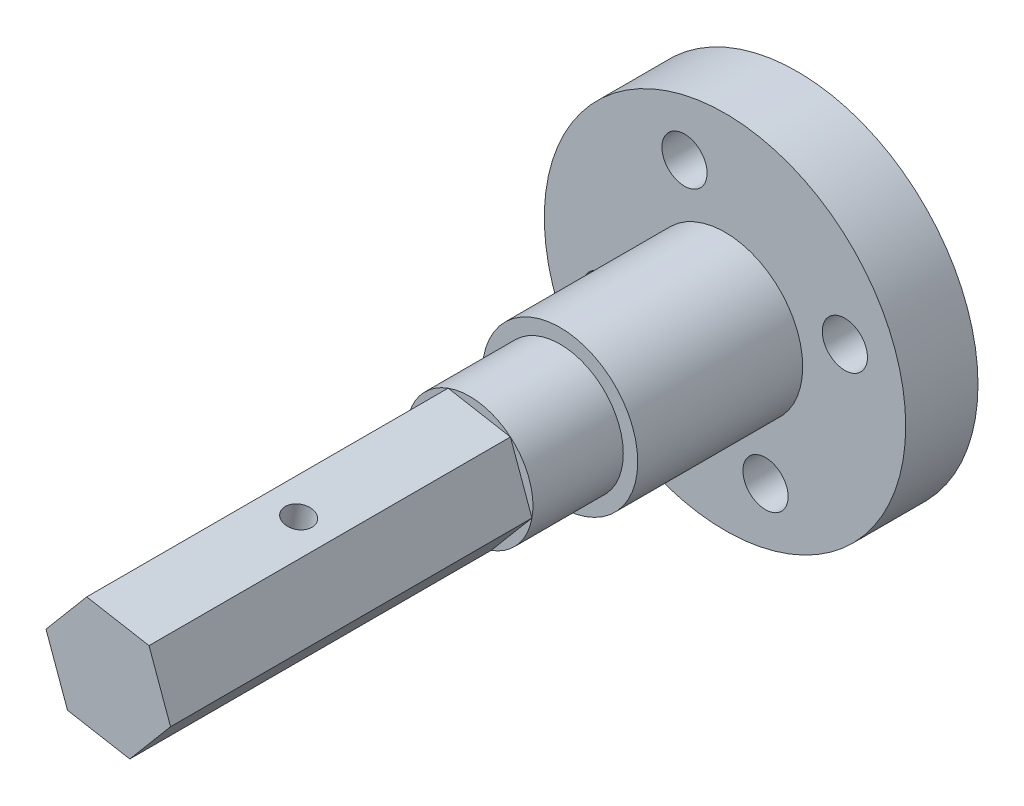
ISO-10303-21;
HEADER;
FILE_DESCRIPTION(('STEP AP214'),'2;1');
FILE_NAME('part.step','',(''),(''),'','','');
FILE_SCHEMA(('AUTOMOTIVE_DESIGN { 1 0 10303 214 1 1 1 1 }'));
ENDSEC;
DATA;
#1=APPLICATION_CONTEXT('core data for automotive mechanical design processes');
#2=APPLICATION_PROTOCOL_DEFINITION('international standard','automotive_design',2000,#1);
#3=PRODUCT_CONTEXT('',#1,'mechanical');
#4=PRODUCT('Part','Part','',(#3));
#5=PRODUCT_RELATED_PRODUCT_CATEGORY('part','',(#4));
#6=PRODUCT_DEFINITION_FORMATION('','',#4);
#7=PRODUCT_DEFINITION_CONTEXT('part definition',#1,'design');
#8=PRODUCT_DEFINITION('design','',#6,#7);
#9=PRODUCT_DEFINITION_SHAPE('','',#8);
#10=(LENGTH_UNIT() NAMED_UNIT(*) SI_UNIT(.MILLI.,.METRE.));
#11=(NAMED_UNIT(*) PLANE_ANGLE_UNIT() SI_UNIT($,.RADIAN.));
#12=(NAMED_UNIT(*) SI_UNIT($,.STERADIAN.) SOLID_ANGLE_UNIT());
#13=UNCERTAINTY_MEASURE_WITH_UNIT(LENGTH_MEASURE(1.E-05),#10,'distance_accuracy_value','');
#14=(GEOMETRIC_REPRESENTATION_CONTEXT(3) GLOBAL_UNCERTAINTY_ASSIGNED_CONTEXT((#13)) GLOBAL_UNIT_ASSIGNED_CONTEXT((#10,
#11,#12)) REPRESENTATION_CONTEXT('',''));
#15=CARTESIAN_POINT('',(0.,0.,0.));
#16=DIRECTION('',(0.,0.,1.));
#17=DIRECTION('',(1.,0.,0.));
#18=AXIS2_PLACEMENT_3D('',#15,#16,#17);
#19=CARTESIAN_POINT('',(0.,0.,4.));
#20=DIRECTION('',(0.,0.,1.));
#21=DIRECTION('',(1.,0.,0.));
#22=AXIS2_PLACEMENT_3D('',#19,#20,#21);
#23=PLANE('',#22);
#24=CARTESIAN_POINT('',(0.,0.,4.));
#25=DIRECTION('',(0.,0.,1.));
#26=DIRECTION('',(1.,0.,0.));
#27=AXIS2_PLACEMENT_3D('',#24,#25,#26);
#28=CIRCLE('',#27,10.);
#29=CARTESIAN_POINT('',(10.,0.,4.));
#30=VERTEX_POINT('',#29);
#31=EDGE_CURVE('E11',#30,#30,#28,.T.);
#32=ORIENTED_EDGE('',*,*,#31,.T.);
#33=EDGE_LOOP('',(#32));
#34=FACE_BOUND('',#33,.T.);
#35=CARTESIAN_POINT('',(2.2413876478337,-6.6314539440562,4.));
#36=DIRECTION('',(0.,0.,1.));
#37=DIRECTION('',(1.,0.,0.));
#38=AXIS2_PLACEMENT_3D('',#35,#36,#37);
#39=CIRCLE('',#38,1.25);
#40=CARTESIAN_POINT('',(3.4913876478337,-6.6314539440562,4.));
#41=VERTEX_POINT('',#40);
#42=EDGE_CURVE('E239',#41,#41,#39,.T.);
#43=ORIENTED_EDGE('',*,*,#42,.F.);
#44=EDGE_LOOP('',(#43));
#45=FACE_BOUND('',#44,.T.);
#46=CARTESIAN_POINT('',(-6.6314539440562,-2.24138764783368,4.));
#47=DIRECTION('',(0.,0.,1.));
#48=DIRECTION('',(1.,0.,0.));
#49=AXIS2_PLACEMENT_3D('',#46,#47,#48);
#50=CIRCLE('',#49,1.25);
#51=CARTESIAN_POINT('',(-5.3814539440562,-2.24138764783368,4.));
#52=VERTEX_POINT('',#51);
#53=EDGE_CURVE('E251',#52,#52,#50,.T.);
#54=ORIENTED_EDGE('',*,*,#53,.F.);
#55=EDGE_LOOP('',(#54));
#56=FACE_BOUND('',#55,.T.);
#57=CARTESIAN_POINT('',(6.63145394405621,2.2413876478337,4.));
#58=DIRECTION('',(0.,0.,1.));
#59=DIRECTION('',(1.,0.,0.));
#60=AXIS2_PLACEMENT_3D('',#57,#58,#59);
#61=CIRCLE('',#60,1.25);
#62=CARTESIAN_POINT('',(7.88145394405621,2.2413876478337,4.));
#63=VERTEX_POINT('',#62);
#64=EDGE_CURVE('E254',#63,#63,#61,.T.);
#65=ORIENTED_EDGE('',*,*,#64,.F.);
#66=EDGE_LOOP('',(#65));
#67=FACE_BOUND('',#66,.T.);
#68=CARTESIAN_POINT('',(-2.24138764783369,6.63145394405621,4.));
#69=DIRECTION('',(0.,0.,1.));
#70=DIRECTION('',(1.,0.,0.));
#71=AXIS2_PLACEMENT_3D('',#68,#69,#70);
#72=CIRCLE('',#71,1.25);
#73=CARTESIAN_POINT('',(-0.991387647833686,6.63145394405621,4.));
#74=VERTEX_POINT('',#73);
#75=EDGE_CURVE('E257',#74,#74,#72,.T.);
#76=ORIENTED_EDGE('',*,*,#75,.F.);
#77=EDGE_LOOP('',(#76));
#78=FACE_BOUND('',#77,.T.);
#79=CARTESIAN_POINT('',(0.,0.,4.));
#80=DIRECTION('',(0.,0.,1.));
#81=DIRECTION('',(1.,0.,0.));
#82=AXIS2_PLACEMENT_3D('',#79,#80,#81);
#83=CIRCLE('',#82,4.3);
#84=CARTESIAN_POINT('',(4.3,0.,4.));
#85=VERTEX_POINT('',#84);
#86=EDGE_CURVE('E221',#85,#85,#83,.T.);
#87=ORIENTED_EDGE('',*,*,#86,.F.);
#88=EDGE_LOOP('',(#87));
#89=FACE_BOUND('',#88,.T.);
#90=ADVANCED_FACE('F33',(#34,#45,#56,#67,#78,#89),#23,.T.);
#91=CARTESIAN_POINT('',(0.,0.,4.));
#92=DIRECTION('',(0.,0.,-1.));
#93=DIRECTION('',(-1.,0.,0.));
#94=AXIS2_PLACEMENT_3D('',#91,#92,#93);
#95=CYLINDRICAL_SURFACE('',#94,10.);
#96=ORIENTED_EDGE('',*,*,#31,.F.);
#97=EDGE_LOOP('',(#96));
#98=FACE_BOUND('',#97,.T.);
#99=CARTESIAN_POINT('',(0.,0.,0.));
#100=DIRECTION('',(0.,0.,1.));
#101=DIRECTION('',(1.,0.,0.));
#102=AXIS2_PLACEMENT_3D('',#99,#100,#101);
#103=CIRCLE('',#102,10.);
#104=CARTESIAN_POINT('',(10.,0.,0.));
#105=VERTEX_POINT('',#104);
#106=EDGE_CURVE('E42',#105,#105,#103,.T.);
#107=ORIENTED_EDGE('',*,*,#106,.T.);
#108=EDGE_LOOP('',(#107));
#109=FACE_BOUND('',#108,.T.);
#110=ADVANCED_FACE('F35',(#98,#109),#95,.T.);
#111=CARTESIAN_POINT('',(0.,0.,0.));
#112=DIRECTION('',(0.,0.,1.));
#113=DIRECTION('',(1.,0.,0.));
#114=AXIS2_PLACEMENT_3D('',#111,#112,#113);
#115=PLANE('',#114);
#116=CARTESIAN_POINT('',(0.,0.,0.));
#117=DIRECTION('',(0.,0.,-1.));
#118=DIRECTION('',(-1.,0.,0.));
#119=AXIS2_PLACEMENT_3D('',#116,#117,#118);
#120=CIRCLE('',#119,2.12708932169634);
#121=CARTESIAN_POINT('',(-2.12708932169634,0.,0.));
#122=VERTEX_POINT('',#121);
#123=EDGE_CURVE('E226',#122,#122,#120,.T.);
#124=ORIENTED_EDGE('',*,*,#123,.F.);
#125=EDGE_LOOP('',(#124));
#126=FACE_BOUND('',#125,.T.);
#127=CARTESIAN_POINT('',(-2.24138764783369,6.63145394405621,0.));
#128=DIRECTION('',(0.,0.,-1.));
#129=DIRECTION('',(-1.,0.,0.));
#130=AXIS2_PLACEMENT_3D('',#127,#128,#129);
#131=CIRCLE('',#130,1.25);
#132=CARTESIAN_POINT('',(-3.49138764783369,6.63145394405621,0.));
#133=VERTEX_POINT('',#132);
#134=EDGE_CURVE('E236',#133,#133,#131,.T.);
#135=ORIENTED_EDGE('',*,*,#134,.F.);
#136=EDGE_LOOP('',(#135));
#137=FACE_BOUND('',#136,.T.);
#138=CARTESIAN_POINT('',(6.63145394405621,2.2413876478337,0.));
#139=DIRECTION('',(0.,0.,-1.));
#140=DIRECTION('',(-1.,0.,0.));
#141=AXIS2_PLACEMENT_3D('',#138,#139,#140);
#142=CIRCLE('',#141,1.25);
#143=CARTESIAN_POINT('',(5.38145394405621,2.2413876478337,0.));
#144=VERTEX_POINT('',#143);
#145=EDGE_CURVE('E240',#144,#144,#142,.T.);
#146=ORIENTED_EDGE('',*,*,#145,.F.);
#147=EDGE_LOOP('',(#146));
#148=FACE_BOUND('',#147,.T.);
#149=CARTESIAN_POINT('',(-6.6314539440562,-2.24138764783368,0.));
#150=DIRECTION('',(0.,0.,-1.));
#151=DIRECTION('',(-1.,0.,0.));
#152=AXIS2_PLACEMENT_3D('',#149,#150,#151);
#153=CIRCLE('',#152,1.25);
#154=CARTESIAN_POINT('',(-7.8814539440562,-2.24138764783368,0.));
#155=VERTEX_POINT('',#154);
#156=EDGE_CURVE('E243',#155,#155,#153,.T.);
#157=ORIENTED_EDGE('',*,*,#156,.F.);
#158=EDGE_LOOP('',(#157));
#159=FACE_BOUND('',#158,.T.);
#160=CARTESIAN_POINT('',(2.2413876478337,-6.6314539440562,0.));
#161=DIRECTION('',(0.,0.,-1.));
#162=DIRECTION('',(-1.,0.,0.));
#163=AXIS2_PLACEMENT_3D('',#160,#161,#162);
#164=CIRCLE('',#163,1.25);
#165=CARTESIAN_POINT('',(0.991387647833694,-6.6314539440562,0.));
#166=VERTEX_POINT('',#165);
#167=EDGE_CURVE('E246',#166,#166,#164,.T.);
#168=ORIENTED_EDGE('',*,*,#167,.F.);
#169=EDGE_LOOP('',(#168));
#170=FACE_BOUND('',#169,.T.);
#171=ORIENTED_EDGE('',*,*,#106,.F.);
#172=EDGE_LOOP('',(#171));
#173=FACE_BOUND('',#172,.T.);
#174=ADVANCED_FACE('F128',(#126,#137,#148,#159,#170,#173),#115,.F.);
#175=CARTESIAN_POINT('',(2.2413876478337,-6.6314539440562,100.));
#176=DIRECTION('',(0.,0.,-1.));
#177=DIRECTION('',(-1.,0.,0.));
#178=AXIS2_PLACEMENT_3D('',#175,#176,#177);
#179=CYLINDRICAL_SURFACE('',#178,1.25);
#180=ORIENTED_EDGE('',*,*,#42,.T.);
#181=EDGE_LOOP('',(#180));
#182=FACE_BOUND('',#181,.T.);
#183=ORIENTED_EDGE('',*,*,#167,.T.);
#184=EDGE_LOOP('',(#183));
#185=FACE_BOUND('',#184,.T.);
#186=ADVANCED_FACE('F130',(#182,#185),#179,.F.);
#187=CARTESIAN_POINT('',(-6.6314539440562,-2.24138764783368,100.));
#188=DIRECTION('',(0.,0.,-1.));
#189=DIRECTION('',(-1.,0.,0.));
#190=AXIS2_PLACEMENT_3D('',#187,#188,#189);
#191=CYLINDRICAL_SURFACE('',#190,1.25);
#192=ORIENTED_EDGE('',*,*,#53,.T.);
#193=EDGE_LOOP('',(#192));
#194=FACE_BOUND('',#193,.T.);
#195=ORIENTED_EDGE('',*,*,#156,.T.);
#196=EDGE_LOOP('',(#195));
#197=FACE_BOUND('',#196,.T.);
#198=ADVANCED_FACE('F136',(#194,#197),#191,.F.);
#199=CARTESIAN_POINT('',(6.63145394405621,2.2413876478337,100.));
#200=DIRECTION('',(0.,0.,-1.));
#201=DIRECTION('',(-1.,0.,0.));
#202=AXIS2_PLACEMENT_3D('',#199,#200,#201);
#203=CYLINDRICAL_SURFACE('',#202,1.25);
#204=ORIENTED_EDGE('',*,*,#64,.T.);
#205=EDGE_LOOP('',(#204));
#206=FACE_BOUND('',#205,.T.);
#207=ORIENTED_EDGE('',*,*,#145,.T.);
#208=EDGE_LOOP('',(#207));
#209=FACE_BOUND('',#208,.T.);
#210=ADVANCED_FACE('F186',(#206,#209),#203,.F.);
#211=CARTESIAN_POINT('',(-2.24138764783369,6.63145394405621,100.));
#212=DIRECTION('',(0.,0.,-1.));
#213=DIRECTION('',(-1.,0.,0.));
#214=AXIS2_PLACEMENT_3D('',#211,#212,#213);
#215=CYLINDRICAL_SURFACE('',#214,1.25);
#216=ORIENTED_EDGE('',*,*,#75,.T.);
#217=EDGE_LOOP('',(#216));
#218=FACE_BOUND('',#217,.T.);
#219=ORIENTED_EDGE('',*,*,#134,.T.);
#220=EDGE_LOOP('',(#219));
#221=FACE_BOUND('',#220,.T.);
#222=ADVANCED_FACE('F190',(#218,#221),#215,.F.);
#223=CARTESIAN_POINT('',(0.,0.,1.5));
#224=DIRECTION('',(0.,0.,-1.));
#225=DIRECTION('',(-1.,0.,0.));
#226=AXIS2_PLACEMENT_3D('',#223,#224,#225);
#227=CYLINDRICAL_SURFACE('',#226,2.12708932169634);
#228=CARTESIAN_POINT('',(0.,0.,1.5));
#229=DIRECTION('',(0.,0.,-1.));
#230=DIRECTION('',(-1.,0.,0.));
#231=AXIS2_PLACEMENT_3D('',#228,#229,#230);
#232=CIRCLE('',#231,2.12708932169634);
#233=CARTESIAN_POINT('',(-2.12708932169634,0.,1.5));
#234=VERTEX_POINT('',#233);
#235=EDGE_CURVE('E228',#234,#234,#232,.T.);
#236=ORIENTED_EDGE('',*,*,#235,.F.);
#237=EDGE_LOOP('',(#236));
#238=FACE_BOUND('',#237,.T.);
#239=ORIENTED_EDGE('',*,*,#123,.T.);
#240=EDGE_LOOP('',(#239));
#241=FACE_BOUND('',#240,.T.);
#242=ADVANCED_FACE('F194',(#238,#241),#227,.F.);
#243=CARTESIAN_POINT('',(0.,0.,1.5));
#244=DIRECTION('',(0.,0.,-1.));
#245=DIRECTION('',(-1.,0.,0.));
#246=AXIS2_PLACEMENT_3D('',#243,#244,#245);
#247=PLANE('',#246);
#248=ORIENTED_EDGE('',*,*,#235,.T.);
#249=EDGE_LOOP('',(#248));
#250=FACE_BOUND('',#249,.T.);
#251=ADVANCED_FACE('F201',(#250),#247,.T.);
#252=CARTESIAN_POINT('',(0.,0.,13.13));
#253=DIRECTION('',(0.,0.,1.));
#254=DIRECTION('',(1.,0.,0.));
#255=AXIS2_PLACEMENT_3D('',#252,#253,#254);
#256=PLANE('',#255);
#257=CARTESIAN_POINT('',(0.,0.,13.13));
#258=DIRECTION('',(0.,0.,1.));
#259=DIRECTION('',(1.,0.,0.));
#260=AXIS2_PLACEMENT_3D('',#257,#258,#259);
#261=CIRCLE('',#260,4.3);
#262=CARTESIAN_POINT('',(4.3,0.,13.13));
#263=VERTEX_POINT('',#262);
#264=EDGE_CURVE('E217',#263,#263,#261,.T.);
#265=ORIENTED_EDGE('',*,*,#264,.T.);
#266=EDGE_LOOP('',(#265));
#267=FACE_BOUND('',#266,.T.);
#268=CARTESIAN_POINT('',(0.,0.,13.13));
#269=DIRECTION('',(0.,0.,1.));
#270=DIRECTION('',(1.,0.,0.));
#271=AXIS2_PLACEMENT_3D('',#268,#269,#270);
#272=CIRCLE('',#271,3.5);
#273=CARTESIAN_POINT('',(3.5,0.,13.13));
#274=VERTEX_POINT('',#273);
#275=EDGE_CURVE('E220',#274,#274,#272,.T.);
#276=ORIENTED_EDGE('',*,*,#275,.F.);
#277=EDGE_LOOP('',(#276));
#278=FACE_BOUND('',#277,.T.);
#279=ADVANCED_FACE('F205',(#267,#278),#256,.T.);
#280=CARTESIAN_POINT('',(0.,0.,13.13));
#281=DIRECTION('',(0.,0.,-1.));
#282=DIRECTION('',(-1.,0.,0.));
#283=AXIS2_PLACEMENT_3D('',#280,#281,#282);
#284=CYLINDRICAL_SURFACE('',#283,4.3);
#285=ORIENTED_EDGE('',*,*,#264,.F.);
#286=EDGE_LOOP('',(#285));
#287=FACE_BOUND('',#286,.T.);
#288=ORIENTED_EDGE('',*,*,#86,.T.);
#289=EDGE_LOOP('',(#288));
#290=FACE_BOUND('',#289,.T.);
#291=ADVANCED_FACE('F182',(#287,#290),#284,.T.);
#292=CARTESIAN_POINT('',(0.,0.,38.13));
#293=DIRECTION('',(0.,0.,1.));
#294=DIRECTION('',(1.,0.,0.));
#295=AXIS2_PLACEMENT_3D('',#292,#293,#294);
#296=PLANE('',#295);
#297=DIRECTION('',(-0.984457741442088,0.175621625418806,0.));
#298=VECTOR('',#297,1.);
#299=CARTESIAN_POINT('',(2.25512580925675,2.67664110116094,38.13));
#300=LINE('',#299,#298);
#301=CARTESIAN_POINT('',(2.25512580925675,2.67664110116094,38.13));
#302=VERTEX_POINT('',#301);
#303=CARTESIAN_POINT('',(-1.19047628579055,3.29131679012676,38.13));
#304=VERTEX_POINT('',#303);
#305=EDGE_CURVE('E102',#302,#304,#300,.T.);
#306=ORIENTED_EDGE('',*,*,#305,.T.);
#307=DIRECTION('',(-0.644321659787644,-0.764754600331698,0.));
#308=VECTOR('',#307,1.);
#309=CARTESIAN_POINT('',(-1.19047628579055,3.29131679012676,38.13));
#310=LINE('',#309,#308);
#311=CARTESIAN_POINT('',(-3.44560209504731,0.614675688965819,38.13));
#312=VERTEX_POINT('',#311);
#313=EDGE_CURVE('E90',#304,#312,#310,.T.);
#314=ORIENTED_EDGE('',*,*,#313,.T.);
#315=DIRECTION('',(0.340136081654443,-0.940376225750504,0.));
#316=VECTOR('',#315,1.);
#317=CARTESIAN_POINT('',(-3.44560209504731,0.614675688965819,38.13));
#318=LINE('',#317,#316);
#319=CARTESIAN_POINT('',(-2.25512580925675,-2.67664110116094,38.13));
#320=VERTEX_POINT('',#319);
#321=EDGE_CURVE('E101',#312,#320,#318,.T.);
#322=ORIENTED_EDGE('',*,*,#321,.T.);
#323=DIRECTION('',(0.984457741442088,-0.175621625418806,0.));
#324=VECTOR('',#323,1.);
#325=CARTESIAN_POINT('',(-2.25512580925675,-2.67664110116094,38.13));
#326=LINE('',#325,#324);
#327=CARTESIAN_POINT('',(1.19047628579055,-3.29131679012676,38.13));
#328=VERTEX_POINT('',#327);
#329=EDGE_CURVE('E261',#320,#328,#326,.T.);
#330=ORIENTED_EDGE('',*,*,#329,.T.);
#331=DIRECTION('',(0.644321659787644,0.764754600331698,0.));
#332=VECTOR('',#331,1.);
#333=CARTESIAN_POINT('',(1.19047628579055,-3.29131679012676,38.13));
#334=LINE('',#333,#332);
#335=CARTESIAN_POINT('',(3.4456020950473,-0.614675688965818,38.13));
#336=VERTEX_POINT('',#335);
#337=EDGE_CURVE('E263',#328,#336,#334,.T.);
#338=ORIENTED_EDGE('',*,*,#337,.T.);
#339=DIRECTION('',(-0.340136081654444,0.940376225750503,0.));
#340=VECTOR('',#339,1.);
#341=CARTESIAN_POINT('',(3.4456020950473,-0.614675688965818,38.13));
#342=LINE('',#341,#340);
#343=EDGE_CURVE('E107',#336,#302,#342,.T.);
#344=ORIENTED_EDGE('',*,*,#343,.T.);
#345=EDGE_LOOP('',(#306,#314,#322,#330,#338,#344));
#346=FACE_BOUND('',#345,.T.);
#347=ADVANCED_FACE('F105',(#346),#296,.T.);
#348=CARTESIAN_POINT('',(-1.92637799413021,-10.7984294345454,28.1279491924304));
#349=DIRECTION('',(0.175621625418806,0.984457741442088,0.));
#350=DIRECTION('',(-0.984457741442088,0.175621625418806,0.));
#351=AXIS2_PLACEMENT_3D('',#348,#349,#350);
#352=CYLINDRICAL_SURFACE('',#351,0.749999999999956);
#353=CARTESIAN_POINT('',(0.532324761733067,2.98397894564386,28.1279491924304));
#354=DIRECTION('',(0.175621625418806,0.984457741442088,0.));
#355=DIRECTION('',(-0.984457741442088,0.175621625418806,0.));
#356=AXIS2_PLACEMENT_3D('',#353,#354,#355);
#357=CIRCLE('',#356,0.749999999999956);
#358=CARTESIAN_POINT('',(-0.206018544348456,3.11569516470795,28.1279491924304));
#359=VERTEX_POINT('',#358);
#360=EDGE_CURVE('E231',#359,#359,#357,.T.);
#361=ORIENTED_EDGE('',*,*,#360,.T.);
#362=EDGE_LOOP('',(#361));
#363=FACE_BOUND('',#362,.T.);
#364=CARTESIAN_POINT('',(-0.532324761733136,-2.98397894564384,28.1279491924304));
#365=DIRECTION('',(0.175621625418806,0.984457741442088,0.));
#366=DIRECTION('',(-0.984457741442088,0.175621625418806,0.));
#367=AXIS2_PLACEMENT_3D('',#364,#365,#366);
#368=CIRCLE('',#367,0.749999999999956);
#369=CARTESIAN_POINT('',(-1.27066806781466,-2.85226272657975,28.1279491924304));
#370=VERTEX_POINT('',#369);
#371=EDGE_CURVE('E37',#370,#370,#368,.T.);
#372=ORIENTED_EDGE('',*,*,#371,.F.);
#373=EDGE_LOOP('',(#372));
#374=FACE_BOUND('',#373,.T.);
#375=ADVANCED_FACE('F166',(#363,#374),#352,.F.);
#376=CARTESIAN_POINT('',(-1.19047628579055,3.29131679012676,38.13));
#377=DIRECTION('',(0.764754600331698,-0.644321659787644,0.));
#378=DIRECTION('',(0.644321659787644,0.764754600331698,0.));
#379=AXIS2_PLACEMENT_3D('',#376,#377,#378);
#380=PLANE('',#379);
#381=DIRECTION('',(-0.644321659787644,-0.764754600331698,0.));
#382=VECTOR('',#381,1.);
#383=CARTESIAN_POINT('',(-1.19047628579055,3.29131679012676,18.13));
#384=LINE('',#383,#382);
#385=CARTESIAN_POINT('',(-1.19047628579055,3.29131679012676,18.13));
#386=VERTEX_POINT('',#385);
#387=CARTESIAN_POINT('',(-3.44560209504731,0.614675688965819,18.13));
#388=VERTEX_POINT('',#387);
#389=EDGE_CURVE('E268',#386,#388,#384,.T.);
#390=ORIENTED_EDGE('',*,*,#389,.T.);
#391=DIRECTION('',(0.,0.,-1.));
#392=VECTOR('',#391,1.);
#393=CARTESIAN_POINT('',(-3.44560209504731,0.614675688965819,38.13));
#394=LINE('',#393,#392);
#395=EDGE_CURVE('E98',#312,#388,#394,.T.);
#396=ORIENTED_EDGE('',*,*,#395,.F.);
#397=ORIENTED_EDGE('',*,*,#313,.F.);
#398=DIRECTION('',(0.,0.,-1.));
#399=VECTOR('',#398,1.);
#400=CARTESIAN_POINT('',(-1.19047628579055,3.29131679012676,38.13));
#401=LINE('',#400,#399);
#402=EDGE_CURVE('E95',#304,#386,#401,.T.);
#403=ORIENTED_EDGE('',*,*,#402,.T.);
#404=EDGE_LOOP('',(#390,#396,#397,#403));
#405=FACE_BOUND('',#404,.T.);
#406=ADVANCED_FACE('F93',(#405),#380,.F.);
#407=CARTESIAN_POINT('',(-3.44560209504731,0.614675688965819,38.13));
#408=DIRECTION('',(0.940376225750504,0.340136081654443,0.));
#409=DIRECTION('',(-0.340136081654443,0.940376225750504,0.));
#410=AXIS2_PLACEMENT_3D('',#407,#408,#409);
#411=PLANE('',#410);
#412=DIRECTION('',(0.340136081654443,-0.940376225750504,0.));
#413=VECTOR('',#412,1.);
#414=CARTESIAN_POINT('',(-3.44560209504731,0.614675688965819,18.13));
#415=LINE('',#414,#413);
#416=CARTESIAN_POINT('',(-2.25512580925675,-2.67664110116094,18.13));
#417=VERTEX_POINT('',#416);
#418=EDGE_CURVE('E270',#388,#417,#415,.T.);
#419=ORIENTED_EDGE('',*,*,#418,.T.);
#420=DIRECTION('',(0.,0.,-1.));
#421=VECTOR('',#420,1.);
#422=CARTESIAN_POINT('',(-2.25512580925675,-2.67664110116094,38.13));
#423=LINE('',#422,#421);
#424=EDGE_CURVE('E119',#320,#417,#423,.T.);
#425=ORIENTED_EDGE('',*,*,#424,.F.);
#426=ORIENTED_EDGE('',*,*,#321,.F.);
#427=ORIENTED_EDGE('',*,*,#395,.T.);
#428=EDGE_LOOP('',(#419,#425,#426,#427));
#429=FACE_BOUND('',#428,.T.);
#430=ADVANCED_FACE('F165',(#429),#411,.F.);
#431=CARTESIAN_POINT('',(-2.25512580925675,-2.67664110116094,38.13));
#432=DIRECTION('',(0.175621625418806,0.984457741442088,0.));
#433=DIRECTION('',(-0.984457741442088,0.175621625418806,0.));
#434=AXIS2_PLACEMENT_3D('',#431,#432,#433);
#435=PLANE('',#434);
#436=ORIENTED_EDGE('',*,*,#371,.T.);
#437=EDGE_LOOP('',(#436));
#438=FACE_BOUND('',#437,.T.);
#439=DIRECTION('',(0.984457741442088,-0.175621625418806,0.));
#440=VECTOR('',#439,1.);
#441=CARTESIAN_POINT('',(-2.25512580925675,-2.67664110116094,18.13));
#442=LINE('',#441,#440);
#443=CARTESIAN_POINT('',(1.19047628579056,-3.29131679012676,18.13));
#444=VERTEX_POINT('',#443);
#445=EDGE_CURVE('E273',#417,#444,#442,.T.);
#446=ORIENTED_EDGE('',*,*,#445,.T.);
#447=DIRECTION('',(0.,0.,-1.));
#448=VECTOR('',#447,1.);
#449=CARTESIAN_POINT('',(1.19047628579055,-3.29131679012676,38.13));
#450=LINE('',#449,#448);
#451=EDGE_CURVE('E282',#328,#444,#450,.T.);
#452=ORIENTED_EDGE('',*,*,#451,.F.);
#453=ORIENTED_EDGE('',*,*,#329,.F.);
#454=ORIENTED_EDGE('',*,*,#424,.T.);
#455=EDGE_LOOP('',(#446,#452,#453,#454));
#456=FACE_BOUND('',#455,.T.);
#457=ADVANCED_FACE('F169',(#438,#456),#435,.F.);
#458=CARTESIAN_POINT('',(1.19047628579055,-3.29131679012676,38.13));
#459=DIRECTION('',(-0.764754600331698,0.644321659787644,0.));
#460=DIRECTION('',(-0.644321659787644,-0.764754600331698,0.));
#461=AXIS2_PLACEMENT_3D('',#458,#459,#460);
#462=PLANE('',#461);
#463=DIRECTION('',(0.644321659787644,0.764754600331698,0.));
#464=VECTOR('',#463,1.);
#465=CARTESIAN_POINT('',(1.19047628579055,-3.29131679012676,18.13));
#466=LINE('',#465,#464);
#467=CARTESIAN_POINT('',(3.44560209504731,-0.614675688965814,18.13));
#468=VERTEX_POINT('',#467);
#469=EDGE_CURVE('E56',#444,#468,#466,.T.);
#470=ORIENTED_EDGE('',*,*,#469,.T.);
#471=DIRECTION('',(0.,0.,-1.));
#472=VECTOR('',#471,1.);
#473=CARTESIAN_POINT('',(3.4456020950473,-0.614675688965818,38.13));
#474=LINE('',#473,#472);
#475=EDGE_CURVE('E279',#336,#468,#474,.T.);
#476=ORIENTED_EDGE('',*,*,#475,.F.);
#477=ORIENTED_EDGE('',*,*,#337,.F.);
#478=ORIENTED_EDGE('',*,*,#451,.T.);
#479=EDGE_LOOP('',(#470,#476,#477,#478));
#480=FACE_BOUND('',#479,.T.);
#481=ADVANCED_FACE('F173',(#480),#462,.F.);
#482=CARTESIAN_POINT('',(3.4456020950473,-0.614675688965818,38.13));
#483=DIRECTION('',(-0.940376225750503,-0.340136081654444,0.));
#484=DIRECTION('',(0.340136081654444,-0.940376225750503,0.));
#485=AXIS2_PLACEMENT_3D('',#482,#483,#484);
#486=PLANE('',#485);
#487=DIRECTION('',(-0.340136081654444,0.940376225750503,0.));
#488=VECTOR('',#487,1.);
#489=CARTESIAN_POINT('',(3.4456020950473,-0.614675688965818,18.13));
#490=LINE('',#489,#488);
#491=CARTESIAN_POINT('',(2.25512580925675,2.67664110116095,18.13));
#492=VERTEX_POINT('',#491);
#493=EDGE_CURVE('E49',#468,#492,#490,.T.);
#494=ORIENTED_EDGE('',*,*,#493,.T.);
#495=DIRECTION('',(0.,0.,-1.));
#496=VECTOR('',#495,1.);
#497=CARTESIAN_POINT('',(2.25512580925675,2.67664110116094,38.13));
#498=LINE('',#497,#496);
#499=EDGE_CURVE('E266',#302,#492,#498,.T.);
#500=ORIENTED_EDGE('',*,*,#499,.F.);
#501=ORIENTED_EDGE('',*,*,#343,.F.);
#502=ORIENTED_EDGE('',*,*,#475,.T.);
#503=EDGE_LOOP('',(#494,#500,#501,#502));
#504=FACE_BOUND('',#503,.T.);
#505=ADVANCED_FACE('F161',(#504),#486,.F.);
#506=CARTESIAN_POINT('',(2.25512580925675,2.67664110116094,38.13));
#507=DIRECTION('',(-0.175621625418806,-0.984457741442088,0.));
#508=DIRECTION('',(0.984457741442088,-0.175621625418806,0.));
#509=AXIS2_PLACEMENT_3D('',#506,#507,#508);
#510=PLANE('',#509);
#511=ORIENTED_EDGE('',*,*,#360,.F.);
#512=EDGE_LOOP('',(#511));
#513=FACE_BOUND('',#512,.T.);
#514=DIRECTION('',(-0.984457741442088,0.175621625418806,0.));
#515=VECTOR('',#514,1.);
#516=CARTESIAN_POINT('',(2.25512580925675,2.67664110116094,18.13));
#517=LINE('',#516,#515);
#518=EDGE_CURVE('E113',#492,#386,#517,.T.);
#519=ORIENTED_EDGE('',*,*,#518,.T.);
#520=ORIENTED_EDGE('',*,*,#402,.F.);
#521=ORIENTED_EDGE('',*,*,#305,.F.);
#522=ORIENTED_EDGE('',*,*,#499,.T.);
#523=EDGE_LOOP('',(#519,#520,#521,#522));
#524=FACE_BOUND('',#523,.T.);
#525=ADVANCED_FACE('F112',(#513,#524),#510,.F.);
#526=CARTESIAN_POINT('',(0.,0.,18.13));
#527=DIRECTION('',(0.,0.,1.));
#528=DIRECTION('',(1.,0.,0.));
#529=AXIS2_PLACEMENT_3D('',#526,#527,#528);
#530=PLANE('',#529);
#531=ORIENTED_EDGE('',*,*,#389,.F.);
#532=CARTESIAN_POINT('',(0.,0.,18.13));
#533=DIRECTION('',(0.,0.,1.));
#534=DIRECTION('',(1.,0.,0.));
#535=AXIS2_PLACEMENT_3D('',#532,#533,#534);
#536=CIRCLE('',#535,3.5);
#537=EDGE_CURVE('E123',#386,#388,#536,.T.);
#538=ORIENTED_EDGE('',*,*,#537,.T.);
#539=EDGE_LOOP('',(#531,#538));
#540=FACE_BOUND('',#539,.T.);
#541=ADVANCED_FACE('F154',(#540),#530,.T.);
#542=ORIENTED_EDGE('',*,*,#418,.F.);
#543=EDGE_CURVE('E293',#388,#417,#536,.T.);
#544=ORIENTED_EDGE('',*,*,#543,.T.);
#545=EDGE_LOOP('',(#542,#544));
#546=FACE_BOUND('',#545,.T.);
#547=ADVANCED_FACE('F157',(#546),#530,.T.);
#548=ORIENTED_EDGE('',*,*,#445,.F.);
#549=EDGE_CURVE('E302',#417,#444,#536,.T.);
#550=ORIENTED_EDGE('',*,*,#549,.T.);
#551=EDGE_LOOP('',(#548,#550));
#552=FACE_BOUND('',#551,.T.);
#553=ADVANCED_FACE('F306',(#552),#530,.T.);
#554=ORIENTED_EDGE('',*,*,#469,.F.);
#555=EDGE_CURVE('E116',#444,#468,#536,.T.);
#556=ORIENTED_EDGE('',*,*,#555,.T.);
#557=EDGE_LOOP('',(#554,#556));
#558=FACE_BOUND('',#557,.T.);
#559=ADVANCED_FACE('F301',(#558),#530,.T.);
#560=ORIENTED_EDGE('',*,*,#493,.F.);
#561=EDGE_CURVE('E114',#468,#492,#536,.T.);
#562=ORIENTED_EDGE('',*,*,#561,.T.);
#563=EDGE_LOOP('',(#560,#562));
#564=FACE_BOUND('',#563,.T.);
#565=ADVANCED_FACE('F299',(#564),#530,.T.);
#566=ORIENTED_EDGE('',*,*,#518,.F.);
#567=EDGE_CURVE('E118',#492,#386,#536,.T.);
#568=ORIENTED_EDGE('',*,*,#567,.T.);
#569=EDGE_LOOP('',(#566,#568));
#570=FACE_BOUND('',#569,.T.);
#571=ADVANCED_FACE('F152',(#570),#530,.T.);
#572=CARTESIAN_POINT('',(0.,0.,18.13));
#573=DIRECTION('',(0.,0.,-1.));
#574=DIRECTION('',(-1.,0.,0.));
#575=AXIS2_PLACEMENT_3D('',#572,#573,#574);
#576=CYLINDRICAL_SURFACE('',#575,3.5);
#577=ORIENTED_EDGE('',*,*,#275,.T.);
#578=EDGE_LOOP('',(#577));
#579=FACE_BOUND('',#578,.T.);
#580=ORIENTED_EDGE('',*,*,#567,.F.);
#581=ORIENTED_EDGE('',*,*,#561,.F.);
#582=ORIENTED_EDGE('',*,*,#555,.F.);
#583=ORIENTED_EDGE('',*,*,#549,.F.);
#584=ORIENTED_EDGE('',*,*,#543,.F.);
#585=ORIENTED_EDGE('',*,*,#537,.F.);
#586=EDGE_LOOP('',(#580,#581,#582,#583,#584,#585));
#587=FACE_BOUND('',#586,.T.);
#588=ADVANCED_FACE('F149',(#579,#587),#576,.T.);
#589=CLOSED_SHELL('',(#90,#110,#174,#186,#198,#210,#222,#242,#251,#279,#291,#347,#375,#406,#430,
#457,#481,#505,#525,#541,#547,#553,#559,#565,#571,#588));
#590=MANIFOLD_SOLID_BREP('B2',#589);
#591=ADVANCED_BREP_SHAPE_REPRESENTATION('',(#18,#590),#14);
#592=SHAPE_DEFINITION_REPRESENTATION(#9,#591);
ENDSEC;
END-ISO-10303-21;
